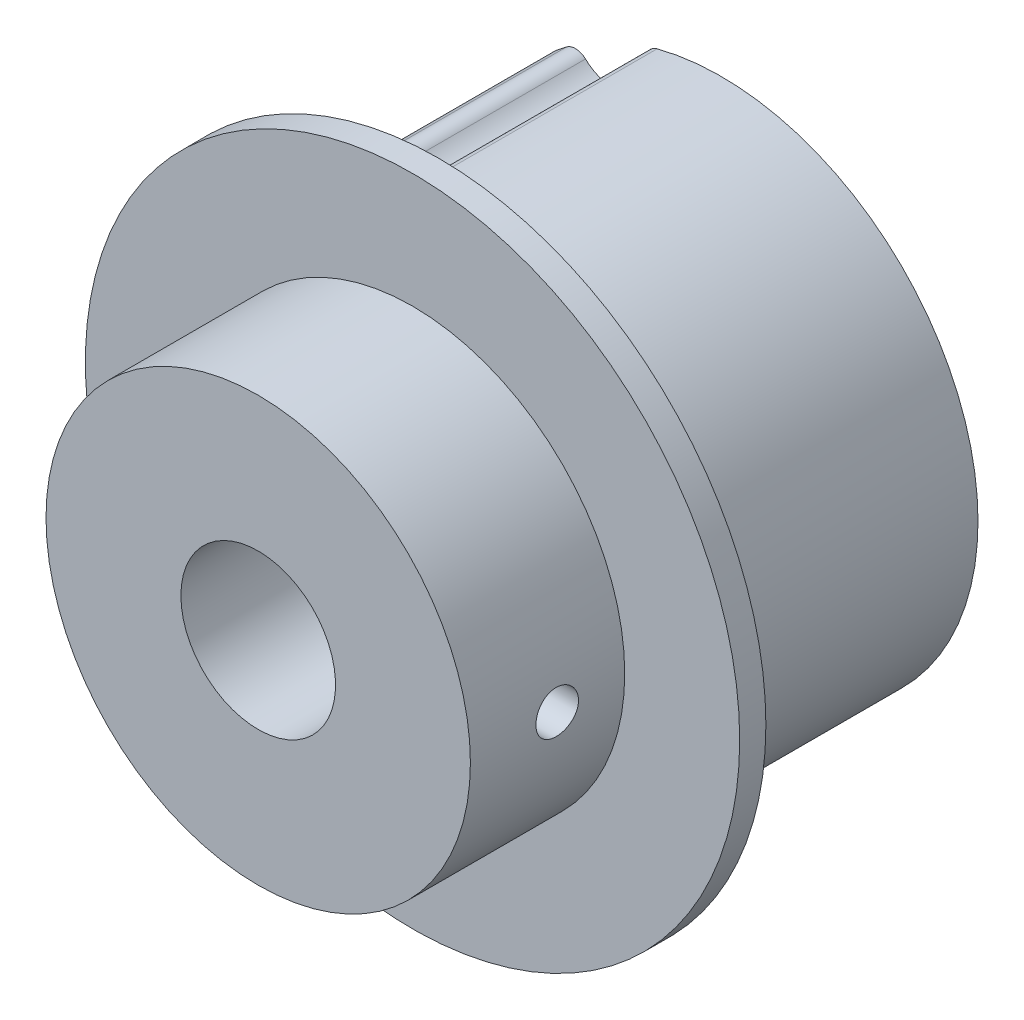
ISO-10303-21;
HEADER;
FILE_DESCRIPTION(('STEP AP214'),'2;1');
FILE_NAME('part.step','',(''),(''),'','','');
FILE_SCHEMA(('AUTOMOTIVE_DESIGN { 1 0 10303 214 1 1 1 1 }'));
ENDSEC;
DATA;
#1=APPLICATION_CONTEXT('core data for automotive mechanical design processes');
#2=APPLICATION_PROTOCOL_DEFINITION('international standard','automotive_design',2000,#1);
#3=PRODUCT_CONTEXT('',#1,'mechanical');
#4=PRODUCT('Part','Part','',(#3));
#5=PRODUCT_RELATED_PRODUCT_CATEGORY('part','',(#4));
#6=PRODUCT_DEFINITION_FORMATION('','',#4);
#7=PRODUCT_DEFINITION_CONTEXT('part definition',#1,'design');
#8=PRODUCT_DEFINITION('design','',#6,#7);
#9=PRODUCT_DEFINITION_SHAPE('','',#8);
#10=(LENGTH_UNIT() NAMED_UNIT(*) SI_UNIT(.MILLI.,.METRE.));
#11=(NAMED_UNIT(*) PLANE_ANGLE_UNIT() SI_UNIT($,.RADIAN.));
#12=(NAMED_UNIT(*) SI_UNIT($,.STERADIAN.) SOLID_ANGLE_UNIT());
#13=UNCERTAINTY_MEASURE_WITH_UNIT(LENGTH_MEASURE(1.E-05),#10,'distance_accuracy_value','');
#14=(GEOMETRIC_REPRESENTATION_CONTEXT(3) GLOBAL_UNCERTAINTY_ASSIGNED_CONTEXT((#13)) GLOBAL_UNIT_ASSIGNED_CONTEXT((#10,
#11,#12)) REPRESENTATION_CONTEXT('',''));
#15=CARTESIAN_POINT('',(0.,0.,0.));
#16=DIRECTION('',(0.,0.,1.));
#17=DIRECTION('',(1.,0.,0.));
#18=AXIS2_PLACEMENT_3D('',#15,#16,#17);
#19=CARTESIAN_POINT('',(0.,0.,13.49375));
#20=DIRECTION('',(0.,0.,-1.));
#21=DIRECTION('',(-1.,0.,0.));
#22=AXIS2_PLACEMENT_3D('',#19,#20,#21);
#23=CYLINDRICAL_SURFACE('',#22,3.18135);
#24=CARTESIAN_POINT('',(3.18135,0.,9.045575));
#25=CARTESIAN_POINT('',(3.18134841128343,-0.0481893943951871,9.04557754429007));
#26=CARTESIAN_POINT('',(3.18024298845227,-0.0964335547292547,9.04956791922159));
#27=CARTESIAN_POINT('',(3.1759353654732,-0.191573484811042,9.06540831663995));
#28=CARTESIAN_POINT('',(3.17272934101652,-0.238466632063338,9.077272674836));
#29=CARTESIAN_POINT('',(3.16457466220837,-0.329449970853951,9.10844309631712));
#30=CARTESIAN_POINT('',(3.15962928961197,-0.373545257646135,9.12773515166962));
#31=CARTESIAN_POINT('',(3.14851760225123,-0.457859625360472,9.17316920470743));
#32=CARTESIAN_POINT('',(3.14235155403727,-0.498079549672782,9.19930970734763));
#33=CARTESIAN_POINT('',(3.12929072619131,-0.574513195352826,9.25838377064851));
#34=CARTESIAN_POINT('',(3.12238278346796,-0.61061784951194,9.2914555529729));
#35=CARTESIAN_POINT('',(3.1086994626396,-0.676846842823859,9.36315970856861));
#36=CARTESIAN_POINT('',(3.10192411036523,-0.706970026947473,9.40179315332408));
#37=CARTESIAN_POINT('',(3.08913865023835,-0.760917411740671,9.48440057553412));
#38=CARTESIAN_POINT('',(3.08314497886407,-0.784615059156058,9.52845997873882));
#39=CARTESIAN_POINT('',(3.07279466027877,-0.824222549668575,9.62012938590107));
#40=CARTESIAN_POINT('',(3.06843767702726,-0.840133991612145,9.66773865860032));
#41=CARTESIAN_POINT('',(3.06198946318021,-0.86333728324876,9.76395087965073));
#42=CARTESIAN_POINT('',(3.05984641038301,-0.870826661539665,9.81250263053884));
#43=CARTESIAN_POINT('',(3.05791403428716,-0.877589320778472,9.91021715350185));
#44=CARTESIAN_POINT('',(3.05812424135696,-0.876864241055676,9.95937980170605));
#45=CARTESIAN_POINT('',(3.06082836184337,-0.86737498103517,10.0553625355372));
#46=CARTESIAN_POINT('',(3.06325376749431,-0.85885194837192,10.1022087022432));
#47=CARTESIAN_POINT('',(3.07000504534929,-0.834395708839866,10.1937792124117));
#48=CARTESIAN_POINT('',(3.07433108991607,-0.818461829897933,10.2385033630279));
#49=CARTESIAN_POINT('',(3.08445515923665,-0.779444059813929,10.3251798679962));
#50=CARTESIAN_POINT('',(3.09027014540672,-0.756277055716914,10.3670927434637));
#51=CARTESIAN_POINT('',(3.10270754980193,-0.703510106023451,10.4465171446987));
#52=CARTESIAN_POINT('',(3.10933008550084,-0.673909224003207,10.4840280285496));
#53=CARTESIAN_POINT('',(3.12291891433506,-0.607896089575789,10.5549560963033));
#54=CARTESIAN_POINT('',(3.12988915724795,-0.571282941371303,10.5881858040724));
#55=CARTESIAN_POINT('',(3.14318526025427,-0.492901554098853,10.64808641099));
#56=CARTESIAN_POINT('',(3.1495108435139,-0.451131117240939,10.6747544993008));
#57=CARTESIAN_POINT('',(3.1608491773403,-0.363305959994821,10.7208650491048));
#58=CARTESIAN_POINT('',(3.16585434053572,-0.317228455148668,10.7402660088295));
#59=CARTESIAN_POINT('',(3.1739253063138,-0.222350425059078,10.7709555571985));
#60=CARTESIAN_POINT('',(3.17699512787984,-0.173555773330067,10.7822609639702));
#61=CARTESIAN_POINT('',(3.17972928272051,-0.103619486643986,10.7922759282538));
#62=CARTESIAN_POINT('',(3.18033546992572,-0.082965325340154,10.7944857857713));
#63=CARTESIAN_POINT('',(3.18114617161247,-0.0415441698215398,10.7974358721658));
#64=CARTESIAN_POINT('',(3.18135068498563,-0.0207771752955613,10.7981760969875));
#65=CARTESIAN_POINT('',(3.18134841128344,0.0481893943951848,10.7981724557099));
#66=CARTESIAN_POINT('',(3.18024298845228,0.0964335547292519,10.7941820807784));
#67=CARTESIAN_POINT('',(3.1759353654732,0.19157348481104,10.77834168336));
#68=CARTESIAN_POINT('',(3.17272934101652,0.238466632063337,10.766477325164));
#69=CARTESIAN_POINT('',(3.16457466220837,0.329449970853952,10.7353069036829));
#70=CARTESIAN_POINT('',(3.15962928961197,0.373545257646136,10.7160148483304));
#71=CARTESIAN_POINT('',(3.14851760225123,0.457859625360474,10.6705807952926));
#72=CARTESIAN_POINT('',(3.14235155403727,0.498079549672782,10.6444402926524));
#73=CARTESIAN_POINT('',(3.12929072619131,0.574513195352826,10.5853662293515));
#74=CARTESIAN_POINT('',(3.12238278346796,0.61061784951194,10.5522944470271));
#75=CARTESIAN_POINT('',(3.1086994626396,0.676846842823859,10.4805902914314));
#76=CARTESIAN_POINT('',(3.10192411036523,0.706970026947473,10.4419568466759));
#77=CARTESIAN_POINT('',(3.08913865023835,0.760917411740671,10.3593494244659));
#78=CARTESIAN_POINT('',(3.08314497886407,0.784615059156057,10.3152900212612));
#79=CARTESIAN_POINT('',(3.07279466027877,0.824222549668575,10.2236206140989));
#80=CARTESIAN_POINT('',(3.06843767702726,0.840133991612145,10.1760113413997));
#81=CARTESIAN_POINT('',(3.06198946318021,0.86333728324876,10.0797991203493));
#82=CARTESIAN_POINT('',(3.05984641038301,0.870826661539665,10.0312473694612));
#83=CARTESIAN_POINT('',(3.05791403428716,0.877589320778472,9.93353284649815));
#84=CARTESIAN_POINT('',(3.05812424135696,0.876864241055676,9.88437019829395));
#85=CARTESIAN_POINT('',(3.06082836184337,0.86737498103517,9.78838746446278));
#86=CARTESIAN_POINT('',(3.06325376749431,0.858851948371921,9.74154129775683));
#87=CARTESIAN_POINT('',(3.07000504534929,0.834395708839867,9.64997078758832));
#88=CARTESIAN_POINT('',(3.07433108991607,0.818461829897933,9.60524663697213));
#89=CARTESIAN_POINT('',(3.08445515923665,0.779444059813929,9.51857013200384));
#90=CARTESIAN_POINT('',(3.09027014540672,0.756277055716915,9.47665725653625));
#91=CARTESIAN_POINT('',(3.10270754980193,0.703510106023452,9.39723285530135));
#92=CARTESIAN_POINT('',(3.10933008550084,0.673909224003207,9.35972197145043));
#93=CARTESIAN_POINT('',(3.12291891433506,0.607896089575789,9.28879390369665));
#94=CARTESIAN_POINT('',(3.12988915724795,0.571282941371303,9.25556419592761));
#95=CARTESIAN_POINT('',(3.14318526025427,0.492901554098853,9.19566358901004));
#96=CARTESIAN_POINT('',(3.1495108435139,0.451131117240939,9.16899550069922));
#97=CARTESIAN_POINT('',(3.1608491773403,0.363305959994821,9.12288495089521));
#98=CARTESIAN_POINT('',(3.16585434053572,0.317228455148668,9.10348399117052));
#99=CARTESIAN_POINT('',(3.1739253063138,0.222350425059077,9.07279444280147));
#100=CARTESIAN_POINT('',(3.17699512787984,0.173555773330066,9.06148903602985));
#101=CARTESIAN_POINT('',(3.17972928272051,0.103619486643986,9.05147407174618));
#102=CARTESIAN_POINT('',(3.18033546992572,0.0829653253401542,9.04926421422868));
#103=CARTESIAN_POINT('',(3.18114617161247,0.0415441698215395,9.04631412783419));
#104=CARTESIAN_POINT('',(3.18135068498563,0.0207771752955602,9.04557390301255));
#105=CARTESIAN_POINT('',(3.18135,0.,9.045575));
#106=B_SPLINE_CURVE_WITH_KNOTS('',3,(#24,#25,#26,#27,#28,#29,#30,#31,#32,#33,#34,#35,#36,#37,
#38,#39,#40,#41,#42,#43,#44,#45,#46,#47,#48,#49,#50,#51,#52,#53,#54,#55,#56,#57,#58,#59,#60,#61,
#62,#63,#64,#65,#66,#67,#68,#69,#70,#71,#72,#73,#74,#75,#76,#77,#78,#79,#80,#81,#82,#83,#84,#85,
#86,#87,#88,#89,#90,#91,#92,#93,#94,#95,#96,#97,#98,#99,#100,#101,#102,#103,#104,#105),
.UNSPECIFIED.,.T.,.F.,(4,2,2,2,2,2,2,2,2,2,2,2,2,2,2,2,2,2,2,2,2,2,2,2,2,2,2,2,2,2,2,2,2,2,2,2,
2,2,2,2,4),(0.,0.144488377736948,0.289240541482826,0.433721043074943,0.578170030204596,
0.725833451323394,0.873525358759691,1.02394383604916,1.17433141291198,1.32111306899122,
1.46786543290902,1.61022753532876,1.75260255076833,1.8966778057285,2.04077404429288,
2.18987597815134,2.33904167287127,2.48904669860112,2.63873918472978,2.7010361300674,
2.76333324730844,2.90782162504539,3.05257378879127,3.19705429038339,3.34150327751304,
3.48916669863184,3.63685860606813,3.78727708335761,3.93766466022042,4.08444631629966,
4.23119868021747,4.3735607826372,4.51593579807677,4.66001105303694,4.80410729160133,
4.95320922545978,5.10237492017971,5.25237994590956,5.40207243203822,5.46436937737585,
5.52666649461689),.UNSPECIFIED.);
#107=CARTESIAN_POINT('',(3.18135,0.,9.045575));
#108=VERTEX_POINT('',#107);
#109=EDGE_CURVE('E38',#108,#108,#106,.T.);
#110=ORIENTED_EDGE('',*,*,#109,.F.);
#111=EDGE_LOOP('',(#110));
#112=FACE_BOUND('',#111,.T.);
#113=CARTESIAN_POINT('',(0.,0.,13.49375));
#114=DIRECTION('',(0.,0.,-1.));
#115=DIRECTION('',(-1.,0.,0.));
#116=AXIS2_PLACEMENT_3D('',#113,#114,#115);
#117=CIRCLE('',#116,3.18135);
#118=CARTESIAN_POINT('',(-3.18135,0.,13.49375));
#119=VERTEX_POINT('',#118);
#120=EDGE_CURVE('E212',#119,#119,#117,.T.);
#121=ORIENTED_EDGE('',*,*,#120,.F.);
#122=EDGE_LOOP('',(#121));
#123=FACE_BOUND('',#122,.T.);
#124=CARTESIAN_POINT('',(0.,0.,-5.55625));
#125=DIRECTION('',(0.,0.,-1.));
#126=DIRECTION('',(-1.,0.,0.));
#127=AXIS2_PLACEMENT_3D('',#124,#125,#126);
#128=CIRCLE('',#127,3.18135);
#129=CARTESIAN_POINT('',(-3.18135,0.,-5.55625));
#130=VERTEX_POINT('',#129);
#131=EDGE_CURVE('E238',#130,#130,#128,.F.);
#132=ORIENTED_EDGE('',*,*,#131,.F.);
#133=EDGE_LOOP('',(#132));
#134=FACE_BOUND('',#133,.T.);
#135=ADVANCED_FACE('F34',(#112,#123,#134),#23,.F.);
#136=CARTESIAN_POINT('',(0.,0.,13.49375));
#137=DIRECTION('',(0.,0.,1.));
#138=DIRECTION('',(1.,0.,0.));
#139=AXIS2_PLACEMENT_3D('',#136,#137,#138);
#140=PLANE('',#139);
#141=ORIENTED_EDGE('',*,*,#120,.T.);
#142=EDGE_LOOP('',(#141));
#143=FACE_BOUND('',#142,.T.);
#144=CARTESIAN_POINT('',(0.,0.,13.49375));
#145=DIRECTION('',(0.,0.,1.));
#146=DIRECTION('',(1.,0.,0.));
#147=AXIS2_PLACEMENT_3D('',#144,#145,#146);
#148=CIRCLE('',#147,8.73125);
#149=CARTESIAN_POINT('',(8.73125,0.,13.49375));
#150=VERTEX_POINT('',#149);
#151=EDGE_CURVE('E209',#150,#150,#148,.F.);
#152=ORIENTED_EDGE('',*,*,#151,.F.);
#153=EDGE_LOOP('',(#152));
#154=FACE_BOUND('',#153,.T.);
#155=ADVANCED_FACE('F36',(#143,#154),#140,.T.);
#156=CARTESIAN_POINT('',(0.,0.,9.921875));
#157=DIRECTION('',(-1.,0.,0.));
#158=DIRECTION('',(0.,0.,1.));
#159=AXIS2_PLACEMENT_3D('',#156,#157,#158);
#160=CYLINDRICAL_SURFACE('',#159,0.8763);
#161=ORIENTED_EDGE('',*,*,#109,.T.);
#162=EDGE_LOOP('',(#161));
#163=FACE_BOUND('',#162,.T.);
#164=CARTESIAN_POINT('',(8.73125,0.,10.798175));
#165=CARTESIAN_POINT('',(8.73124910036505,0.0490599260598818,10.7981710471338));
#166=CARTESIAN_POINT('',(8.73083194377037,0.0981611052276523,10.7940398514306));
#167=CARTESIAN_POINT('',(8.72920628542201,0.195047567693096,10.7776092950651));
#168=CARTESIAN_POINT('',(8.72799612106251,0.242829866020774,10.7652927724224));
#169=CARTESIAN_POINT('',(8.72492138404998,0.335596285002959,10.7328543844939));
#170=CARTESIAN_POINT('',(8.72305745719067,0.380583115615679,10.7127402197469));
#171=CARTESIAN_POINT('',(8.71888396161317,0.466521240776585,10.6652916869772));
#172=CARTESIAN_POINT('',(8.71657458734335,0.507474284427691,10.6379604674561));
#173=CARTESIAN_POINT('',(8.71175897568934,0.584356974756563,10.576742225632));
#174=CARTESIAN_POINT('',(8.70925211089828,0.620269513468087,10.5428337647352));
#175=CARTESIAN_POINT('',(8.70432914759082,0.685905822298732,10.4694677969302));
#176=CARTESIAN_POINT('',(8.70191305772755,0.71562900363734,10.4300097627005));
#177=CARTESIAN_POINT('',(8.69743915546719,0.76809901236908,10.3465628060867));
#178=CARTESIAN_POINT('',(8.69538211255125,0.790830934149677,10.3025644665244));
#179=CARTESIAN_POINT('',(8.69186671880915,0.828577701415579,10.2113515062519));
#180=CARTESIAN_POINT('',(8.69040834786573,0.843592806214576,10.1641369936774));
#181=CARTESIAN_POINT('',(8.6882608950464,0.865430771221417,10.0680009563374));
#182=CARTESIAN_POINT('',(8.68756922722907,0.872281175303693,10.0190857470887));
#183=CARTESIAN_POINT('',(8.68702546344219,0.877680421406713,9.9207952575065));
#184=CARTESIAN_POINT('',(8.6871733467379,0.876229468449398,9.87141998856539));
#185=CARTESIAN_POINT('',(8.68828961316532,0.865089912220661,9.77380140890658));
#186=CARTESIAN_POINT('',(8.68925499285887,0.855431462401511,9.72555461810784));
#187=CARTESIAN_POINT('',(8.69189279949484,0.828197853454266,9.63136986202329));
#188=CARTESIAN_POINT('',(8.69356524248193,0.810622514675772,9.58543194915694));
#189=CARTESIAN_POINT('',(8.69743225435607,0.768020037687419,9.49707271573068));
#190=CARTESIAN_POINT('',(8.69962777664596,0.742979271243872,9.45465800946672));
#191=CARTESIAN_POINT('',(8.70429252590947,0.686168851401518,9.3746254294583));
#192=CARTESIAN_POINT('',(8.70676173833957,0.654399555465836,9.33700730105853));
#193=CARTESIAN_POINT('',(8.71170872306345,0.584871615147312,9.26746316235356));
#194=CARTESIAN_POINT('',(8.7141864871327,0.547088088119497,9.23556202486407));
#195=CARTESIAN_POINT('',(8.71886266553508,0.466669026701758,9.17853652384356));
#196=CARTESIAN_POINT('',(8.72106095019883,0.424031257364837,9.1534152999471));
#197=CARTESIAN_POINT('',(8.72493154178951,0.335081528024233,9.11066557515421));
#198=CARTESIAN_POINT('',(8.72660332211766,0.288765947140964,9.09304456967051));
#199=CARTESIAN_POINT('',(8.72922523155603,0.193889002865032,9.06587576932256));
#200=CARTESIAN_POINT('',(8.7301768908388,0.145332635307131,9.05631085129871));
#201=CARTESIAN_POINT('',(8.73107197375254,0.0643625993434024,9.04734667207088));
#202=CARTESIAN_POINT('',(8.73125059028648,0.0321901798094672,9.0455724063664));
#203=CARTESIAN_POINT('',(8.73124910036505,-0.0490599260598827,9.04557895286617));
#204=CARTESIAN_POINT('',(8.73083194377037,-0.0981611052276533,9.04971014856944));
#205=CARTESIAN_POINT('',(8.72920628542201,-0.195047567693097,9.06614070493494));
#206=CARTESIAN_POINT('',(8.72799612106251,-0.242829866020775,9.07845722757756));
#207=CARTESIAN_POINT('',(8.72492138404998,-0.33559628500296,9.11089561550606));
#208=CARTESIAN_POINT('',(8.72305745719067,-0.38058311561568,9.13100978025305));
#209=CARTESIAN_POINT('',(8.71888396161317,-0.466521240776586,9.17845831302283));
#210=CARTESIAN_POINT('',(8.71657458734335,-0.507474284427691,9.20578953254394));
#211=CARTESIAN_POINT('',(8.71175897568934,-0.584356974756564,9.26700777436799));
#212=CARTESIAN_POINT('',(8.70925211089828,-0.620269513468089,9.3009162352648));
#213=CARTESIAN_POINT('',(8.70432914759082,-0.685905822298734,9.37428220306979));
#214=CARTESIAN_POINT('',(8.70191305772755,-0.715629003637341,9.41374023729953));
#215=CARTESIAN_POINT('',(8.69743915546719,-0.76809901236908,9.49718719391333));
#216=CARTESIAN_POINT('',(8.69538211255125,-0.790830934149677,9.54118553347561));
#217=CARTESIAN_POINT('',(8.69186671880915,-0.828577701415579,9.63239849374809));
#218=CARTESIAN_POINT('',(8.69040834786573,-0.843592806214576,9.67961300632256));
#219=CARTESIAN_POINT('',(8.6882608950464,-0.865430771221417,9.77574904366259));
#220=CARTESIAN_POINT('',(8.68756922722907,-0.872281175303693,9.82466425291132));
#221=CARTESIAN_POINT('',(8.68702546344219,-0.877680421406713,9.9229547424935));
#222=CARTESIAN_POINT('',(8.6871733467379,-0.876229468449398,9.97233001143461));
#223=CARTESIAN_POINT('',(8.68828961316532,-0.865089912220661,10.0699485910934));
#224=CARTESIAN_POINT('',(8.68925499285887,-0.855431462401511,10.1181953818922));
#225=CARTESIAN_POINT('',(8.69189279949484,-0.828197853454266,10.2123801379767));
#226=CARTESIAN_POINT('',(8.69356524248193,-0.810622514675772,10.2583180508431));
#227=CARTESIAN_POINT('',(8.69743225435607,-0.768020037687419,10.3466772842693));
#228=CARTESIAN_POINT('',(8.69962777664596,-0.742979271243872,10.3890919905333));
#229=CARTESIAN_POINT('',(8.70429252590947,-0.686168851401518,10.4691245705417));
#230=CARTESIAN_POINT('',(8.70676173833957,-0.654399555465835,10.5067426989415));
#231=CARTESIAN_POINT('',(8.71170872306345,-0.584871615147311,10.5762868376464));
#232=CARTESIAN_POINT('',(8.7141864871327,-0.547088088119496,10.6081879751359));
#233=CARTESIAN_POINT('',(8.71886266553508,-0.466669026701757,10.6652134761564));
#234=CARTESIAN_POINT('',(8.72106095019883,-0.424031257364837,10.6903347000529));
#235=CARTESIAN_POINT('',(8.72493154178951,-0.335081528024233,10.7330844248458));
#236=CARTESIAN_POINT('',(8.72660332211766,-0.288765947140964,10.7507054303295));
#237=CARTESIAN_POINT('',(8.72922523155603,-0.193889002865031,10.7778742306774));
#238=CARTESIAN_POINT('',(8.7301768908388,-0.145332635307131,10.7874391487013));
#239=CARTESIAN_POINT('',(8.73107197375254,-0.0643625993434024,10.7964033279291));
#240=CARTESIAN_POINT('',(8.73125059028648,-0.0321901798094676,10.7981775936336));
#241=CARTESIAN_POINT('',(8.73125,0.,10.798175));
#242=B_SPLINE_CURVE_WITH_KNOTS('',3,(#164,#165,#166,#167,#168,#169,#170,#171,#172,#173,#174,
#175,#176,#177,#178,#179,#180,#181,#182,#183,#184,#185,#186,#187,#188,#189,#190,#191,#192,#193,
#194,#195,#196,#197,#198,#199,#200,#201,#202,#203,#204,#205,#206,#207,#208,#209,#210,#211,#212,
#213,#214,#215,#216,#217,#218,#219,#220,#221,#222,#223,#224,#225,#226,#227,#228,#229,#230,#231,
#232,#233,#234,#235,#236,#237,#238,#239,#240,#241),.UNSPECIFIED.,.T.,.F.,(4,2,2,2,2,2,2,2,2,2,2,
2,2,2,2,2,2,2,2,2,2,2,2,2,2,2,2,2,2,2,2,2,2,2,2,2,2,2,4),(0.,0.147077343312324,
0.294464037196071,0.441705549038897,0.588882931338588,0.73654835573108,0.884227820813253,
1.03221999529279,1.18020719636078,1.32769373195796,1.47517662503679,1.62212001295694,
1.76906673549103,1.91628337105351,2.06349218747452,2.21132668633078,2.359229527208,
2.50727983108364,2.65501465517008,2.75151798298479,2.89859532629711,3.04598202018086,
3.19322353202369,3.34040091432338,3.48806633871587,3.63574580379804,3.78373797827758,
3.93172517934557,4.07921171494276,4.22669460802158,4.37363799594173,4.52058471847582,
4.66780135403831,4.81501017045931,4.96284466931557,5.11074751019279,5.25879781406843,
5.40653263815486,5.50303596596958),.UNSPECIFIED.);
#243=CARTESIAN_POINT('',(8.73125,0.,10.798175));
#244=VERTEX_POINT('',#243);
#245=EDGE_CURVE('E203',#244,#244,#242,.T.);
#246=ORIENTED_EDGE('',*,*,#245,.F.);
#247=EDGE_LOOP('',(#246));
#248=FACE_BOUND('',#247,.T.);
#249=ADVANCED_FACE('F181',(#163,#248),#160,.F.);
#250=CARTESIAN_POINT('',(0.,0.,-6.67350464587232));
#251=DIRECTION('',(0.,0.,1.));
#252=DIRECTION('',(1.,0.,0.));
#253=AXIS2_PLACEMENT_3D('',#250,#251,#252);
#254=CYLINDRICAL_SURFACE('',#253,10.5664);
#255=DIRECTION('',(0.,0.,1.));
#256=VECTOR('',#255,1.);
#257=CARTESIAN_POINT('',(-6.81279382708512,8.07679696597752,5.55625));
#258=LINE('',#257,#256);
#259=CARTESIAN_POINT('',(-6.81279382793805,8.07679696525829,5.55625));
#260=VERTEX_POINT('',#259);
#261=CARTESIAN_POINT('',(-6.81279382793816,8.07679696525842,-5.55625));
#262=VERTEX_POINT('',#261);
#263=EDGE_CURVE('E228',#260,#262,#258,.F.);
#264=ORIENTED_EDGE('',*,*,#263,.F.);
#265=CARTESIAN_POINT('',(0.,0.,5.55625));
#266=DIRECTION('',(0.,0.,1.));
#267=DIRECTION('',(1.,0.,0.));
#268=AXIS2_PLACEMENT_3D('',#265,#266,#267);
#269=CIRCLE('',#268,10.5664);
#270=CARTESIAN_POINT('',(-6.35830555701132,8.43923926688077,5.55624999999999));
#271=VERTEX_POINT('',#270);
#272=EDGE_CURVE('E224',#260,#271,#269,.F.);
#273=ORIENTED_EDGE('',*,*,#272,.T.);
#274=DIRECTION('',(0.,0.,1.));
#275=VECTOR('',#274,1.);
#276=CARTESIAN_POINT('',(-6.35830555790211,8.43923926620915,5.55625));
#277=LINE('',#276,#275);
#278=CARTESIAN_POINT('',(-6.35830555701109,8.43923926688046,-5.55625));
#279=VERTEX_POINT('',#278);
#280=EDGE_CURVE('E242',#279,#271,#277,.T.);
#281=ORIENTED_EDGE('',*,*,#280,.F.);
#282=CARTESIAN_POINT('',(0.,0.,-5.55625));
#283=DIRECTION('',(0.,0.,1.));
#284=DIRECTION('',(1.,0.,0.));
#285=AXIS2_PLACEMENT_3D('',#282,#283,#284);
#286=CIRCLE('',#285,10.5664);
#287=EDGE_CURVE('E235',#279,#262,#286,.T.);
#288=ORIENTED_EDGE('',*,*,#287,.T.);
#289=EDGE_LOOP('',(#264,#273,#281,#288));
#290=FACE_BOUND('',#289,.T.);
#291=ADVANCED_FACE('F194',(#290),#254,.T.);
#292=CARTESIAN_POINT('',(0.,0.,-6.67350464587232));
#293=DIRECTION('',(0.,0.,1.));
#294=DIRECTION('',(1.,0.,0.));
#295=AXIS2_PLACEMENT_3D('',#292,#293,#294);
#296=CYLINDRICAL_SURFACE('',#295,10.5664);
#297=CARTESIAN_POINT('',(0.,0.,-5.55625));
#298=DIRECTION('',(0.,0.,1.));
#299=DIRECTION('',(1.,0.,0.));
#300=AXIS2_PLACEMENT_3D('',#297,#298,#299);
#301=CIRCLE('',#300,10.5664);
#302=CARTESIAN_POINT('',(-9.39028404790077,4.84472645871161,-5.55625));
#303=VERTEX_POINT('',#302);
#304=CARTESIAN_POINT('',(-9.64250600978822,4.32098215816374,-5.55625));
#305=VERTEX_POINT('',#304);
#306=EDGE_CURVE('E216',#303,#305,#301,.T.);
#307=ORIENTED_EDGE('',*,*,#306,.T.);
#308=DIRECTION('',(0.,0.,1.));
#309=VECTOR('',#308,1.);
#310=CARTESIAN_POINT('',(-9.64250600933228,4.32098215918119,5.55625));
#311=LINE('',#310,#309);
#312=CARTESIAN_POINT('',(-9.64250600978946,4.32098215816429,5.55625));
#313=VERTEX_POINT('',#312);
#314=EDGE_CURVE('E304',#313,#305,#311,.F.);
#315=ORIENTED_EDGE('',*,*,#314,.F.);
#316=CARTESIAN_POINT('',(0.,0.,5.55625));
#317=DIRECTION('',(0.,0.,1.));
#318=DIRECTION('',(1.,0.,0.));
#319=AXIS2_PLACEMENT_3D('',#316,#317,#318);
#320=CIRCLE('',#319,10.5664);
#321=CARTESIAN_POINT('',(-9.39028404790029,4.84472645871136,5.55625));
#322=VERTEX_POINT('',#321);
#323=EDGE_CURVE('E218',#313,#322,#320,.F.);
#324=ORIENTED_EDGE('',*,*,#323,.T.);
#325=DIRECTION('',(0.,0.,1.));
#326=VECTOR('',#325,1.);
#327=CARTESIAN_POINT('',(-9.39028404841109,4.84472645772086,5.55625));
#328=LINE('',#327,#326);
#329=EDGE_CURVE('E232',#303,#322,#328,.T.);
#330=ORIENTED_EDGE('',*,*,#329,.F.);
#331=EDGE_LOOP('',(#307,#315,#324,#330));
#332=FACE_BOUND('',#331,.T.);
#333=ADVANCED_FACE('F191',(#332),#296,.T.);
#334=CARTESIAN_POINT('',(0.,0.,7.14375));
#335=DIRECTION('',(0.,0.,1.));
#336=DIRECTION('',(1.,0.,0.));
#337=AXIS2_PLACEMENT_3D('',#334,#335,#336);
#338=CYLINDRICAL_SURFACE('',#337,8.73125);
#339=CARTESIAN_POINT('',(0.,0.,7.14375));
#340=DIRECTION('',(0.,0.,1.));
#341=DIRECTION('',(1.,0.,0.));
#342=AXIS2_PLACEMENT_3D('',#339,#340,#341);
#343=CIRCLE('',#342,8.73125);
#344=CARTESIAN_POINT('',(8.73125,0.,7.14375));
#345=VERTEX_POINT('',#344);
#346=EDGE_CURVE('E294',#345,#345,#343,.F.);
#347=ORIENTED_EDGE('',*,*,#346,.F.);
#348=EDGE_LOOP('',(#347));
#349=FACE_BOUND('',#348,.T.);
#350=ORIENTED_EDGE('',*,*,#151,.T.);
#351=EDGE_LOOP('',(#350));
#352=FACE_BOUND('',#351,.T.);
#353=ORIENTED_EDGE('',*,*,#245,.T.);
#354=EDGE_LOOP('',(#353));
#355=FACE_BOUND('',#354,.T.);
#356=ADVANCED_FACE('F188',(#349,#352,#355),#338,.T.);
#357=CARTESIAN_POINT('',(-5.99759399091706,7.960474732181,5.55625));
#358=DIRECTION('',(0.,0.,1.));
#359=DIRECTION('',(1.,0.,0.));
#360=AXIS2_PLACEMENT_3D('',#357,#358,#359);
#361=CYLINDRICAL_SURFACE('',#360,0.59944);
#362=CARTESIAN_POINT('',(-5.99759399091706,7.960474732181,-5.55625));
#363=DIRECTION('',(0.,0.,1.));
#364=DIRECTION('',(1.,0.,0.));
#365=AXIS2_PLACEMENT_3D('',#362,#363,#364);
#366=CIRCLE('',#365,0.59944);
#367=CARTESIAN_POINT('',(-5.58427408826021,8.39463480826753,-5.55625));
#368=VERTEX_POINT('',#367);
#369=EDGE_CURVE('E246',#368,#279,#366,.T.);
#370=ORIENTED_EDGE('',*,*,#369,.T.);
#371=ORIENTED_EDGE('',*,*,#280,.T.);
#372=CARTESIAN_POINT('',(-5.99759399091706,7.960474732181,5.55625));
#373=DIRECTION('',(0.,0.,1.));
#374=DIRECTION('',(1.,0.,0.));
#375=AXIS2_PLACEMENT_3D('',#372,#373,#374);
#376=CIRCLE('',#375,0.59944);
#377=CARTESIAN_POINT('',(-5.58427408826013,8.39463480826761,5.55625));
#378=VERTEX_POINT('',#377);
#379=EDGE_CURVE('E99',#271,#378,#376,.F.);
#380=ORIENTED_EDGE('',*,*,#379,.T.);
#381=DIRECTION('',(0.,0.,1.));
#382=VECTOR('',#381,1.);
#383=CARTESIAN_POINT('',(-5.58427408826038,8.3946348082677,5.55625));
#384=LINE('',#383,#382);
#385=EDGE_CURVE('E297',#378,#368,#384,.F.);
#386=ORIENTED_EDGE('',*,*,#385,.T.);
#387=EDGE_LOOP('',(#370,#371,#380,#386));
#388=FACE_BOUND('',#387,.T.);
#389=ADVANCED_FACE('F315',(#388),#361,.T.);
#390=CARTESIAN_POINT('',(-8.85756601008528,4.56988140093012,5.55625));
#391=DIRECTION('',(0.,0.,1.));
#392=DIRECTION('',(1.,0.,0.));
#393=AXIS2_PLACEMENT_3D('',#390,#391,#392);
#394=CYLINDRICAL_SURFACE('',#393,0.59944);
#395=CARTESIAN_POINT('',(-8.85756601008528,4.56988140093012,-5.55625));
#396=DIRECTION('',(0.,0.,1.));
#397=DIRECTION('',(1.,0.,0.));
#398=AXIS2_PLACEMENT_3D('',#395,#396,#397);
#399=CIRCLE('',#398,0.59944);
#400=CARTESIAN_POINT('',(-8.67355264249433,5.14037889798671,-5.55625));
#401=VERTEX_POINT('',#400);
#402=EDGE_CURVE('E241',#401,#303,#399,.T.);
#403=ORIENTED_EDGE('',*,*,#402,.T.);
#404=ORIENTED_EDGE('',*,*,#329,.T.);
#405=CARTESIAN_POINT('',(-8.85756601008528,4.56988140093012,5.55625));
#406=DIRECTION('',(0.,0.,1.));
#407=DIRECTION('',(1.,0.,0.));
#408=AXIS2_PLACEMENT_3D('',#405,#406,#407);
#409=CIRCLE('',#408,0.59944);
#410=CARTESIAN_POINT('',(-8.67355264249433,5.1403788979867,5.55625));
#411=VERTEX_POINT('',#410);
#412=EDGE_CURVE('E245',#322,#411,#409,.F.);
#413=ORIENTED_EDGE('',*,*,#412,.T.);
#414=DIRECTION('',(0.,0.,1.));
#415=VECTOR('',#414,1.);
#416=CARTESIAN_POINT('',(-8.67355264249442,5.14037889798672,5.55625));
#417=LINE('',#416,#415);
#418=EDGE_CURVE('E322',#411,#401,#417,.F.);
#419=ORIENTED_EDGE('',*,*,#418,.T.);
#420=EDGE_LOOP('',(#403,#404,#413,#419));
#421=FACE_BOUND('',#420,.T.);
#422=ADVANCED_FACE('F426',(#421),#394,.T.);
#423=CARTESIAN_POINT('',(-6.42629879427282,7.61859405981976,5.55625));
#424=DIRECTION('',(0.,0.,1.));
#425=DIRECTION('',(1.,0.,0.));
#426=AXIS2_PLACEMENT_3D('',#423,#424,#425);
#427=CYLINDRICAL_SURFACE('',#426,0.59944);
#428=DIRECTION('',(0.,0.,1.));
#429=VECTOR('',#428,1.);
#430=CARTESIAN_POINT('',(-6.94154590156664,7.31224665567665,5.55625));
#431=LINE('',#430,#429);
#432=CARTESIAN_POINT('',(-6.94154590156642,7.31224665567629,-5.55625));
#433=VERTEX_POINT('',#432);
#434=CARTESIAN_POINT('',(-6.94154590156647,7.31224665567626,5.55625));
#435=VERTEX_POINT('',#434);
#436=EDGE_CURVE('E358',#433,#435,#431,.T.);
#437=ORIENTED_EDGE('',*,*,#436,.T.);
#438=CARTESIAN_POINT('',(-6.42629879427282,7.61859405981976,5.55625));
#439=DIRECTION('',(0.,0.,1.));
#440=DIRECTION('',(1.,0.,0.));
#441=AXIS2_PLACEMENT_3D('',#438,#439,#440);
#442=CIRCLE('',#441,0.59944);
#443=EDGE_CURVE('E305',#435,#260,#442,.F.);
#444=ORIENTED_EDGE('',*,*,#443,.T.);
#445=ORIENTED_EDGE('',*,*,#263,.T.);
#446=CARTESIAN_POINT('',(-6.42629879427282,7.61859405981976,-5.55625));
#447=DIRECTION('',(0.,0.,1.));
#448=DIRECTION('',(1.,0.,0.));
#449=AXIS2_PLACEMENT_3D('',#446,#447,#448);
#450=CIRCLE('',#449,0.59944);
#451=EDGE_CURVE('E231',#262,#433,#450,.T.);
#452=ORIENTED_EDGE('',*,*,#451,.T.);
#453=EDGE_LOOP('',(#437,#444,#445,#452));
#454=FACE_BOUND('',#453,.T.);
#455=ADVANCED_FACE('F356',(#454),#427,.T.);
#456=CARTESIAN_POINT('',(-9.09547922697062,4.07584951553892,5.55625));
#457=DIRECTION('',(0.,0.,1.));
#458=DIRECTION('',(1.,0.,0.));
#459=AXIS2_PLACEMENT_3D('',#456,#457,#458);
#460=CYLINDRICAL_SURFACE('',#459,0.59944);
#461=DIRECTION('',(0.,0.,1.));
#462=VECTOR('',#461,1.);
#463=CARTESIAN_POINT('',(-9.42678167274081,3.57628270016176,5.55625));
#464=LINE('',#463,#462);
#465=CARTESIAN_POINT('',(-9.42678167274022,3.57628270016137,-5.55625));
#466=VERTEX_POINT('',#465);
#467=CARTESIAN_POINT('',(-9.42678167274036,3.57628270016116,5.55625));
#468=VERTEX_POINT('',#467);
#469=EDGE_CURVE('E293',#466,#468,#464,.T.);
#470=ORIENTED_EDGE('',*,*,#469,.T.);
#471=CARTESIAN_POINT('',(-9.09547922697062,4.07584951553892,5.55625));
#472=DIRECTION('',(0.,0.,1.));
#473=DIRECTION('',(1.,0.,0.));
#474=AXIS2_PLACEMENT_3D('',#471,#472,#473);
#475=CIRCLE('',#474,0.59944);
#476=EDGE_CURVE('E298',#468,#313,#475,.F.);
#477=ORIENTED_EDGE('',*,*,#476,.T.);
#478=ORIENTED_EDGE('',*,*,#314,.T.);
#479=CARTESIAN_POINT('',(-9.09547922697062,4.07584951553892,-5.55625));
#480=DIRECTION('',(0.,0.,1.));
#481=DIRECTION('',(1.,0.,0.));
#482=AXIS2_PLACEMENT_3D('',#479,#480,#481);
#483=CIRCLE('',#482,0.59944);
#484=EDGE_CURVE('E301',#305,#466,#483,.T.);
#485=ORIENTED_EDGE('',*,*,#484,.T.);
#486=EDGE_LOOP('',(#470,#477,#478,#485));
#487=FACE_BOUND('',#486,.T.);
#488=ADVANCED_FACE('F341',(#487),#460,.T.);
#489=CARTESIAN_POINT('',(0.,0.,7.14375));
#490=DIRECTION('',(0.,0.,1.));
#491=DIRECTION('',(1.,0.,0.));
#492=AXIS2_PLACEMENT_3D('',#489,#490,#491);
#493=PLANE('',#492);
#494=ORIENTED_EDGE('',*,*,#346,.T.);
#495=EDGE_LOOP('',(#494));
#496=FACE_BOUND('',#495,.T.);
#497=CARTESIAN_POINT('',(0.,0.,7.14375));
#498=DIRECTION('',(0.,0.,1.));
#499=DIRECTION('',(1.,0.,0.));
#500=AXIS2_PLACEMENT_3D('',#497,#498,#499);
#501=CIRCLE('',#500,13.462);
#502=CARTESIAN_POINT('',(13.462,0.,7.14375));
#503=VERTEX_POINT('',#502);
#504=EDGE_CURVE('E280',#503,#503,#501,.F.);
#505=ORIENTED_EDGE('',*,*,#504,.F.);
#506=EDGE_LOOP('',(#505));
#507=FACE_BOUND('',#506,.T.);
#508=ADVANCED_FACE('F418',(#496,#507),#493,.T.);
#509=CARTESIAN_POINT('',(-4.41261724555812,9.62536824429232,5.55625));
#510=DIRECTION('',(0.,0.,1.));
#511=DIRECTION('',(1.,0.,0.));
#512=AXIS2_PLACEMENT_3D('',#509,#510,#511);
#513=CYLINDRICAL_SURFACE('',#512,1.69926);
#514=CARTESIAN_POINT('',(-4.41261724555812,9.62536824429232,-5.55625));
#515=DIRECTION('',(0.,0.,1.));
#516=DIRECTION('',(1.,0.,0.));
#517=AXIS2_PLACEMENT_3D('',#514,#515,#516);
#518=CIRCLE('',#517,1.69926);
#519=CARTESIAN_POINT('',(-3.86128292006528,8.01803660174445,-5.55625));
#520=VERTEX_POINT('',#519);
#521=EDGE_CURVE('E288',#368,#520,#518,.T.);
#522=ORIENTED_EDGE('',*,*,#521,.F.);
#523=ORIENTED_EDGE('',*,*,#385,.F.);
#524=CARTESIAN_POINT('',(-4.41261724555812,9.62536824429232,5.55625));
#525=DIRECTION('',(0.,0.,1.));
#526=DIRECTION('',(1.,0.,0.));
#527=AXIS2_PLACEMENT_3D('',#524,#525,#526);
#528=CIRCLE('',#527,1.69926);
#529=CARTESIAN_POINT('',(-3.86128292006528,8.01803660174445,5.55625));
#530=VERTEX_POINT('',#529);
#531=EDGE_CURVE('E278',#378,#530,#528,.T.);
#532=ORIENTED_EDGE('',*,*,#531,.T.);
#533=DIRECTION('',(0.,0.,1.));
#534=VECTOR('',#533,1.);
#535=CARTESIAN_POINT('',(-3.86128292006768,8.01803660174293,5.55625));
#536=LINE('',#535,#534);
#537=EDGE_CURVE('E285',#530,#520,#536,.F.);
#538=ORIENTED_EDGE('',*,*,#537,.T.);
#539=EDGE_LOOP('',(#522,#523,#532,#538));
#540=FACE_BOUND('',#539,.T.);
#541=ADVANCED_FACE('F319',(#540),#513,.F.);
#542=CARTESIAN_POINT('',(-8.1519215284332,6.75759426040548,5.55625));
#543=DIRECTION('',(0.,0.,1.));
#544=DIRECTION('',(1.,0.,0.));
#545=AXIS2_PLACEMENT_3D('',#542,#543,#544);
#546=CYLINDRICAL_SURFACE('',#545,1.69926);
#547=CARTESIAN_POINT('',(-8.1519215284332,6.75759426040548,-5.55625));
#548=DIRECTION('',(0.,0.,1.));
#549=DIRECTION('',(1.,0.,0.));
#550=AXIS2_PLACEMENT_3D('',#547,#548,#549);
#551=CIRCLE('',#550,1.69926);
#552=CARTESIAN_POINT('',(-6.95779140229231,5.54865348872031,-5.55625));
#553=VERTEX_POINT('',#552);
#554=EDGE_CURVE('E291',#401,#553,#551,.T.);
#555=ORIENTED_EDGE('',*,*,#554,.F.);
#556=ORIENTED_EDGE('',*,*,#418,.F.);
#557=CARTESIAN_POINT('',(-8.1519215284332,6.75759426040548,5.55625));
#558=DIRECTION('',(0.,0.,1.));
#559=DIRECTION('',(1.,0.,0.));
#560=AXIS2_PLACEMENT_3D('',#557,#558,#559);
#561=CIRCLE('',#560,1.69926);
#562=CARTESIAN_POINT('',(-6.95779140229249,5.5486534887205,5.55625));
#563=VERTEX_POINT('',#562);
#564=EDGE_CURVE('E274',#411,#563,#561,.T.);
#565=ORIENTED_EDGE('',*,*,#564,.T.);
#566=DIRECTION('',(0.,0.,1.));
#567=VECTOR('',#566,1.);
#568=CARTESIAN_POINT('',(-6.95779140229189,5.54865348872147,5.55625));
#569=LINE('',#568,#567);
#570=EDGE_CURVE('E360',#563,#553,#569,.F.);
#571=ORIENTED_EDGE('',*,*,#570,.T.);
#572=EDGE_LOOP('',(#555,#556,#565,#571));
#573=FACE_BOUND('',#572,.T.);
#574=ADVANCED_FACE('F368',(#573),#546,.F.);
#575=CARTESIAN_POINT('',(-8.40214045571596,6.44382964986128,5.55625));
#576=DIRECTION('',(0.,0.,1.));
#577=DIRECTION('',(1.,0.,0.));
#578=AXIS2_PLACEMENT_3D('',#575,#576,#577);
#579=CYLINDRICAL_SURFACE('',#578,1.69926);
#580=CARTESIAN_POINT('',(-8.40214045571596,6.44382964986128,-5.55625));
#581=DIRECTION('',(0.,0.,1.));
#582=DIRECTION('',(1.,0.,0.));
#583=AXIS2_PLACEMENT_3D('',#580,#581,#582);
#584=CIRCLE('',#583,1.69926);
#585=EDGE_CURVE('E108',#553,#433,#584,.T.);
#586=ORIENTED_EDGE('',*,*,#585,.F.);
#587=ORIENTED_EDGE('',*,*,#570,.F.);
#588=CARTESIAN_POINT('',(-8.40214045571596,6.44382964986128,5.55625));
#589=DIRECTION('',(0.,0.,1.));
#590=DIRECTION('',(1.,0.,0.));
#591=AXIS2_PLACEMENT_3D('',#588,#589,#590);
#592=CIRCLE('',#591,1.69926);
#593=EDGE_CURVE('E271',#563,#435,#592,.T.);
#594=ORIENTED_EDGE('',*,*,#593,.T.);
#595=ORIENTED_EDGE('',*,*,#436,.F.);
#596=EDGE_LOOP('',(#586,#587,#594,#595));
#597=FACE_BOUND('',#596,.T.);
#598=ADVANCED_FACE('F363',(#597),#579,.F.);
#599=CARTESIAN_POINT('',(-10.3659398770602,2.1601377870757,5.55625));
#600=DIRECTION('',(0.,0.,1.));
#601=DIRECTION('',(1.,0.,0.));
#602=AXIS2_PLACEMENT_3D('',#599,#600,#601);
#603=CYLINDRICAL_SURFACE('',#602,1.69926);
#604=CARTESIAN_POINT('',(-10.3659398770602,2.1601377870757,-5.55625));
#605=DIRECTION('',(0.,0.,1.));
#606=DIRECTION('',(1.,0.,0.));
#607=AXIS2_PLACEMENT_3D('',#604,#605,#606);
#608=CIRCLE('',#607,1.69926);
#609=CARTESIAN_POINT('',(-8.67622396557662,1.98029150249049,-5.55625));
#610=VERTEX_POINT('',#609);
#611=EDGE_CURVE('E164',#610,#466,#608,.T.);
#612=ORIENTED_EDGE('',*,*,#611,.F.);
#613=DIRECTION('',(0.,0.,1.));
#614=VECTOR('',#613,1.);
#615=CARTESIAN_POINT('',(-8.6762239655766,1.98029150249054,5.55625));
#616=LINE('',#615,#614);
#617=CARTESIAN_POINT('',(-8.67622396557662,1.98029150249049,5.55625));
#618=VERTEX_POINT('',#617);
#619=EDGE_CURVE('E262',#610,#618,#616,.T.);
#620=ORIENTED_EDGE('',*,*,#619,.T.);
#621=CARTESIAN_POINT('',(-10.3659398770602,2.1601377870757,5.55625));
#622=DIRECTION('',(0.,0.,1.));
#623=DIRECTION('',(1.,0.,0.));
#624=AXIS2_PLACEMENT_3D('',#621,#622,#623);
#625=CIRCLE('',#624,1.69926);
#626=EDGE_CURVE('E266',#618,#468,#625,.T.);
#627=ORIENTED_EDGE('',*,*,#626,.T.);
#628=ORIENTED_EDGE('',*,*,#469,.F.);
#629=EDGE_LOOP('',(#612,#620,#627,#628));
#630=FACE_BOUND('',#629,.T.);
#631=ADVANCED_FACE('F408',(#630),#603,.F.);
#632=CARTESIAN_POINT('',(-4.77419407162324,9.45124202210858,5.55625));
#633=DIRECTION('',(0.,0.,1.));
#634=DIRECTION('',(1.,0.,0.));
#635=AXIS2_PLACEMENT_3D('',#632,#633,#634);
#636=CYLINDRICAL_SURFACE('',#635,1.69926);
#637=CARTESIAN_POINT('',(-4.77419407162324,9.45124202210858,-5.55625));
#638=DIRECTION('',(0.,0.,1.));
#639=DIRECTION('',(1.,0.,0.));
#640=AXIS2_PLACEMENT_3D('',#637,#638,#639);
#641=CIRCLE('',#640,1.69926);
#642=CARTESIAN_POINT('',(-3.08145183211128,9.59993048221588,-5.55625));
#643=VERTEX_POINT('',#642);
#644=EDGE_CURVE('E283',#520,#643,#641,.T.);
#645=ORIENTED_EDGE('',*,*,#644,.F.);
#646=ORIENTED_EDGE('',*,*,#537,.F.);
#647=CARTESIAN_POINT('',(-4.77419407162324,9.45124202210858,5.55625));
#648=DIRECTION('',(0.,0.,1.));
#649=DIRECTION('',(1.,0.,0.));
#650=AXIS2_PLACEMENT_3D('',#647,#648,#649);
#651=CIRCLE('',#650,1.69926);
#652=CARTESIAN_POINT('',(-3.08145183211085,9.59993048221592,5.55625));
#653=VERTEX_POINT('',#652);
#654=EDGE_CURVE('E276',#530,#653,#651,.T.);
#655=ORIENTED_EDGE('',*,*,#654,.T.);
#656=DIRECTION('',(0.,0.,1.));
#657=VECTOR('',#656,1.);
#658=CARTESIAN_POINT('',(-3.08145183211133,9.5999304822164,5.55625));
#659=LINE('',#658,#657);
#660=EDGE_CURVE('E259',#643,#653,#659,.T.);
#661=ORIENTED_EDGE('',*,*,#660,.F.);
#662=EDGE_LOOP('',(#645,#646,#655,#661));
#663=FACE_BOUND('',#662,.T.);
#664=ADVANCED_FACE('F331',(#663),#636,.F.);
#665=CARTESIAN_POINT('',(0.,0.,-7.14375));
#666=DIRECTION('',(0.,0.,1.));
#667=DIRECTION('',(1.,0.,0.));
#668=AXIS2_PLACEMENT_3D('',#665,#666,#667);
#669=CYLINDRICAL_SURFACE('',#668,13.462);
#670=ORIENTED_EDGE('',*,*,#504,.T.);
#671=EDGE_LOOP('',(#670));
#672=FACE_BOUND('',#671,.T.);
#673=CARTESIAN_POINT('',(0.,0.,6.06682240534027));
#674=DIRECTION('',(0.,0.,1.));
#675=DIRECTION('',(0.,1.,0.));
#676=AXIS2_PLACEMENT_3D('',#673,#674,#675);
#677=CIRCLE('',#676,13.462);
#678=CARTESIAN_POINT('',(0.,13.462,6.06682240534027));
#679=VERTEX_POINT('',#678);
#680=EDGE_CURVE('E255',#679,#679,#677,.F.);
#681=ORIENTED_EDGE('',*,*,#680,.F.);
#682=EDGE_LOOP('',(#681));
#683=FACE_BOUND('',#682,.T.);
#684=ADVANCED_FACE('F402',(#672,#683),#669,.T.);
#685=CARTESIAN_POINT('',(0.,0.,5.55625));
#686=DIRECTION('',(0.,0.,1.));
#687=DIRECTION('',(1.,0.,0.));
#688=AXIS2_PLACEMENT_3D('',#685,#686,#687);
#689=PLANE('',#688);
#690=ORIENTED_EDGE('',*,*,#654,.F.);
#691=ORIENTED_EDGE('',*,*,#531,.F.);
#692=ORIENTED_EDGE('',*,*,#379,.F.);
#693=CARTESIAN_POINT('',(0.,0.,5.55624999999998));
#694=DIRECTION('',(0.,0.,1.));
#695=DIRECTION('',(1.,0.,0.));
#696=AXIS2_PLACEMENT_3D('',#693,#694,#695);
#697=CIRCLE('',#696,10.5663999999996);
#698=CARTESIAN_POINT('',(-2.63372427502886,10.2329030779694,5.55624999999999));
#699=VERTEX_POINT('',#698);
#700=EDGE_CURVE('E253',#699,#271,#697,.T.);
#701=ORIENTED_EDGE('',*,*,#700,.F.);
#702=CARTESIAN_POINT('',(-2.48431107198412,9.65238261462974,5.55625));
#703=DIRECTION('',(0.,0.,1.));
#704=DIRECTION('',(1.,0.,0.));
#705=AXIS2_PLACEMENT_3D('',#702,#703,#704);
#706=CIRCLE('',#705,0.59944);
#707=EDGE_CURVE('E256',#653,#699,#706,.F.);
#708=ORIENTED_EDGE('',*,*,#707,.F.);
#709=EDGE_LOOP('',(#690,#691,#692,#701,#708));
#710=FACE_BOUND('',#709,.T.);
#711=ADVANCED_FACE('F325',(#710),#689,.F.);
#712=CARTESIAN_POINT('',(0.,0.,5.55625));
#713=DIRECTION('',(0.,0.,1.));
#714=DIRECTION('',(1.,0.,0.));
#715=AXIS2_PLACEMENT_3D('',#712,#713,#714);
#716=PLANE('',#715);
#717=ORIENTED_EDGE('',*,*,#593,.F.);
#718=ORIENTED_EDGE('',*,*,#564,.F.);
#719=ORIENTED_EDGE('',*,*,#412,.F.);
#720=CARTESIAN_POINT('',(0.,0.,5.55624999999999));
#721=DIRECTION('',(0.,0.,1.));
#722=DIRECTION('',(1.,0.,0.));
#723=AXIS2_PLACEMENT_3D('',#720,#721,#722);
#724=CIRCLE('',#723,10.5663999999997);
#725=EDGE_CURVE('E250',#260,#322,#724,.T.);
#726=ORIENTED_EDGE('',*,*,#725,.F.);
#727=ORIENTED_EDGE('',*,*,#443,.F.);
#728=EDGE_LOOP('',(#717,#718,#719,#726,#727));
#729=FACE_BOUND('',#728,.T.);
#730=ADVANCED_FACE('F352',(#729),#716,.F.);
#731=CARTESIAN_POINT('',(0.,0.,5.55625));
#732=DIRECTION('',(0.,0.,1.));
#733=DIRECTION('',(1.,0.,0.));
#734=AXIS2_PLACEMENT_3D('',#731,#732,#733);
#735=PLANE('',#734);
#736=ORIENTED_EDGE('',*,*,#626,.F.);
#737=CARTESIAN_POINT('',(-10.2766377758451,2.55139585679168,5.55625));
#738=DIRECTION('',(0.,0.,1.));
#739=DIRECTION('',(1.,0.,0.));
#740=AXIS2_PLACEMENT_3D('',#737,#738,#739);
#741=CIRCLE('',#740,1.69926);
#742=CARTESIAN_POINT('',(-10.04492772174,0.868007904350513,5.55625));
#743=VERTEX_POINT('',#742);
#744=EDGE_CURVE('E263',#618,#743,#741,.F.);
#745=ORIENTED_EDGE('',*,*,#744,.T.);
#746=CARTESIAN_POINT('',(-9.9631884500374,0.274167012308262,5.55625));
#747=DIRECTION('',(0.,0.,1.));
#748=DIRECTION('',(1.,0.,0.));
#749=AXIS2_PLACEMENT_3D('',#746,#747,#748);
#750=CIRCLE('',#749,0.59944);
#751=CARTESIAN_POINT('',(-10.5624016188268,0.290656158722514,5.55625000000002));
#752=VERTEX_POINT('',#751);
#753=EDGE_CURVE('E269',#752,#743,#750,.F.);
#754=ORIENTED_EDGE('',*,*,#753,.F.);
#755=CARTESIAN_POINT('',(0.,0.,5.55625000000004));
#756=DIRECTION('',(0.,0.,1.));
#757=DIRECTION('',(1.,0.,0.));
#758=AXIS2_PLACEMENT_3D('',#755,#756,#757);
#759=CIRCLE('',#758,10.5663999999999);
#760=EDGE_CURVE('E247',#313,#752,#759,.T.);
#761=ORIENTED_EDGE('',*,*,#760,.F.);
#762=ORIENTED_EDGE('',*,*,#476,.F.);
#763=EDGE_LOOP('',(#736,#745,#754,#761,#762));
#764=FACE_BOUND('',#763,.T.);
#765=ADVANCED_FACE('F346',(#764),#735,.F.);
#766=CARTESIAN_POINT('',(-10.2766377758451,2.55139585679168,5.55625));
#767=DIRECTION('',(0.,0.,1.));
#768=DIRECTION('',(1.,0.,0.));
#769=AXIS2_PLACEMENT_3D('',#766,#767,#768);
#770=CYLINDRICAL_SURFACE('',#769,1.69926);
#771=CARTESIAN_POINT('',(-10.2766377758451,2.55139585679168,-5.55625));
#772=DIRECTION('',(0.,0.,1.));
#773=DIRECTION('',(1.,0.,0.));
#774=AXIS2_PLACEMENT_3D('',#771,#772,#773);
#775=CIRCLE('',#774,1.69926);
#776=CARTESIAN_POINT('',(-10.04492772174,0.868007904350513,-5.55625));
#777=VERTEX_POINT('',#776);
#778=EDGE_CURVE('E260',#777,#610,#775,.T.);
#779=ORIENTED_EDGE('',*,*,#778,.F.);
#780=DIRECTION('',(0.,0.,1.));
#781=VECTOR('',#780,1.);
#782=CARTESIAN_POINT('',(-10.0449277217401,0.868007904350488,5.55625));
#783=LINE('',#782,#781);
#784=EDGE_CURVE('E157',#743,#777,#783,.F.);
#785=ORIENTED_EDGE('',*,*,#784,.F.);
#786=ORIENTED_EDGE('',*,*,#744,.F.);
#787=ORIENTED_EDGE('',*,*,#619,.F.);
#788=EDGE_LOOP('',(#779,#785,#786,#787));
#789=FACE_BOUND('',#788,.T.);
#790=ADVANCED_FACE('F385',(#789),#770,.F.);
#791=CARTESIAN_POINT('',(-2.48431107198412,9.65238261462974,5.55625));
#792=DIRECTION('',(0.,0.,1.));
#793=DIRECTION('',(1.,0.,0.));
#794=AXIS2_PLACEMENT_3D('',#791,#792,#793);
#795=CYLINDRICAL_SURFACE('',#794,0.59944);
#796=ORIENTED_EDGE('',*,*,#707,.T.);
#797=DIRECTION('',(0.,0.,1.));
#798=VECTOR('',#797,1.);
#799=CARTESIAN_POINT('',(-2.63372427394822,10.2329030782479,-6.67350464587232));
#800=LINE('',#799,#798);
#801=CARTESIAN_POINT('',(-2.63372427502882,10.2329030779692,-5.55624999999997));
#802=VERTEX_POINT('',#801);
#803=EDGE_CURVE('E156',#802,#699,#800,.T.);
#804=ORIENTED_EDGE('',*,*,#803,.F.);
#805=CARTESIAN_POINT('',(-2.48431107198412,9.65238261462974,-5.55625));
#806=DIRECTION('',(0.,0.,1.));
#807=DIRECTION('',(1.,0.,0.));
#808=AXIS2_PLACEMENT_3D('',#805,#806,#807);
#809=CIRCLE('',#808,0.59944);
#810=EDGE_CURVE('E154',#643,#802,#809,.F.);
#811=ORIENTED_EDGE('',*,*,#810,.F.);
#812=ORIENTED_EDGE('',*,*,#660,.T.);
#813=EDGE_LOOP('',(#796,#804,#811,#812));
#814=FACE_BOUND('',#813,.T.);
#815=ADVANCED_FACE('F383',(#814),#795,.T.);
#816=CARTESIAN_POINT('',(0.,0.,6.06682240534027));
#817=DIRECTION('',(0.,0.,1.));
#818=DIRECTION('',(1.,0.,0.));
#819=AXIS2_PLACEMENT_3D('',#816,#817,#818);
#820=CONICAL_SURFACE('',#819,13.462,1.3962634015952);
#821=ORIENTED_EDGE('',*,*,#680,.T.);
#822=EDGE_LOOP('',(#821));
#823=FACE_BOUND('',#822,.T.);
#824=ORIENTED_EDGE('',*,*,#323,.F.);
#825=ORIENTED_EDGE('',*,*,#760,.T.);
#826=CARTESIAN_POINT('',(0.,0.,5.55625));
#827=DIRECTION('',(0.,0.,1.));
#828=DIRECTION('',(1.,0.,0.));
#829=AXIS2_PLACEMENT_3D('',#826,#827,#828);
#830=CIRCLE('',#829,10.5664);
#831=EDGE_CURVE('E47',#699,#752,#830,.F.);
#832=ORIENTED_EDGE('',*,*,#831,.F.);
#833=ORIENTED_EDGE('',*,*,#700,.T.);
#834=ORIENTED_EDGE('',*,*,#272,.F.);
#835=ORIENTED_EDGE('',*,*,#725,.T.);
#836=EDGE_LOOP('',(#824,#825,#832,#833,#834,#835));
#837=FACE_BOUND('',#836,.T.);
#838=ADVANCED_FACE('F174',(#823,#837),#820,.T.);
#839=CARTESIAN_POINT('',(-9.9631884500374,0.274167012308262,5.55625));
#840=DIRECTION('',(0.,0.,1.));
#841=DIRECTION('',(1.,0.,0.));
#842=AXIS2_PLACEMENT_3D('',#839,#840,#841);
#843=CYLINDRICAL_SURFACE('',#842,0.59944);
#844=CARTESIAN_POINT('',(-9.9631884500374,0.274167012308262,-5.55625));
#845=DIRECTION('',(0.,0.,1.));
#846=DIRECTION('',(1.,0.,0.));
#847=AXIS2_PLACEMENT_3D('',#844,#845,#846);
#848=CIRCLE('',#847,0.59944);
#849=CARTESIAN_POINT('',(-10.5624016188269,0.290656158722515,-5.55625));
#850=VERTEX_POINT('',#849);
#851=EDGE_CURVE('E151',#850,#777,#848,.F.);
#852=ORIENTED_EDGE('',*,*,#851,.F.);
#853=DIRECTION('',(0.,0.,1.));
#854=VECTOR('',#853,1.);
#855=CARTESIAN_POINT('',(-10.5624016188576,0.290656157607522,-6.67350464587232));
#856=LINE('',#855,#854);
#857=EDGE_CURVE('E11',#752,#850,#856,.F.);
#858=ORIENTED_EDGE('',*,*,#857,.F.);
#859=ORIENTED_EDGE('',*,*,#753,.T.);
#860=ORIENTED_EDGE('',*,*,#784,.T.);
#861=EDGE_LOOP('',(#852,#858,#859,#860));
#862=FACE_BOUND('',#861,.T.);
#863=ADVANCED_FACE('F162',(#862),#843,.T.);
#864=CARTESIAN_POINT('',(0.,0.,-6.67350464587232));
#865=DIRECTION('',(0.,0.,1.));
#866=DIRECTION('',(1.,0.,0.));
#867=AXIS2_PLACEMENT_3D('',#864,#865,#866);
#868=CYLINDRICAL_SURFACE('',#867,10.5664);
#869=ORIENTED_EDGE('',*,*,#831,.T.);
#870=ORIENTED_EDGE('',*,*,#857,.T.);
#871=CARTESIAN_POINT('',(0.,0.,-5.55625));
#872=DIRECTION('',(0.,0.,1.));
#873=DIRECTION('',(1.,0.,0.));
#874=AXIS2_PLACEMENT_3D('',#871,#872,#873);
#875=CIRCLE('',#874,10.5664);
#876=EDGE_CURVE('E147',#850,#802,#875,.T.);
#877=ORIENTED_EDGE('',*,*,#876,.T.);
#878=ORIENTED_EDGE('',*,*,#803,.T.);
#879=EDGE_LOOP('',(#869,#870,#877,#878));
#880=FACE_BOUND('',#879,.T.);
#881=ADVANCED_FACE('F166',(#880),#868,.T.);
#882=CARTESIAN_POINT('',(0.,0.,-5.55625));
#883=DIRECTION('',(0.,0.,-1.));
#884=DIRECTION('',(-1.,0.,0.));
#885=AXIS2_PLACEMENT_3D('',#882,#883,#884);
#886=PLANE('',#885);
#887=ORIENTED_EDGE('',*,*,#287,.F.);
#888=ORIENTED_EDGE('',*,*,#369,.F.);
#889=ORIENTED_EDGE('',*,*,#521,.T.);
#890=ORIENTED_EDGE('',*,*,#644,.T.);
#891=ORIENTED_EDGE('',*,*,#810,.T.);
#892=ORIENTED_EDGE('',*,*,#876,.F.);
#893=ORIENTED_EDGE('',*,*,#851,.T.);
#894=ORIENTED_EDGE('',*,*,#778,.T.);
#895=ORIENTED_EDGE('',*,*,#611,.T.);
#896=ORIENTED_EDGE('',*,*,#484,.F.);
#897=ORIENTED_EDGE('',*,*,#306,.F.);
#898=ORIENTED_EDGE('',*,*,#402,.F.);
#899=ORIENTED_EDGE('',*,*,#554,.T.);
#900=ORIENTED_EDGE('',*,*,#585,.T.);
#901=ORIENTED_EDGE('',*,*,#451,.F.);
#902=EDGE_LOOP('',(#887,#888,#889,#890,#891,#892,#893,#894,#895,#896,#897,#898,#899,#900,#901));
#903=FACE_BOUND('',#902,.T.);
#904=ORIENTED_EDGE('',*,*,#131,.T.);
#905=EDGE_LOOP('',(#904));
#906=FACE_BOUND('',#905,.T.);
#907=ADVANCED_FACE('F149',(#903,#906),#886,.T.);
#908=CLOSED_SHELL('',(#135,#155,#249,#291,#333,#356,#389,#422,#455,#488,#508,#541,#574,#598,
#631,#664,#684,#711,#730,#765,#790,#815,#838,#863,#881,#907));
#909=MANIFOLD_SOLID_BREP('B2',#908);
#910=ADVANCED_BREP_SHAPE_REPRESENTATION('',(#18,#909),#14);
#911=SHAPE_DEFINITION_REPRESENTATION(#9,#910);
ENDSEC;
END-ISO-10303-21;
